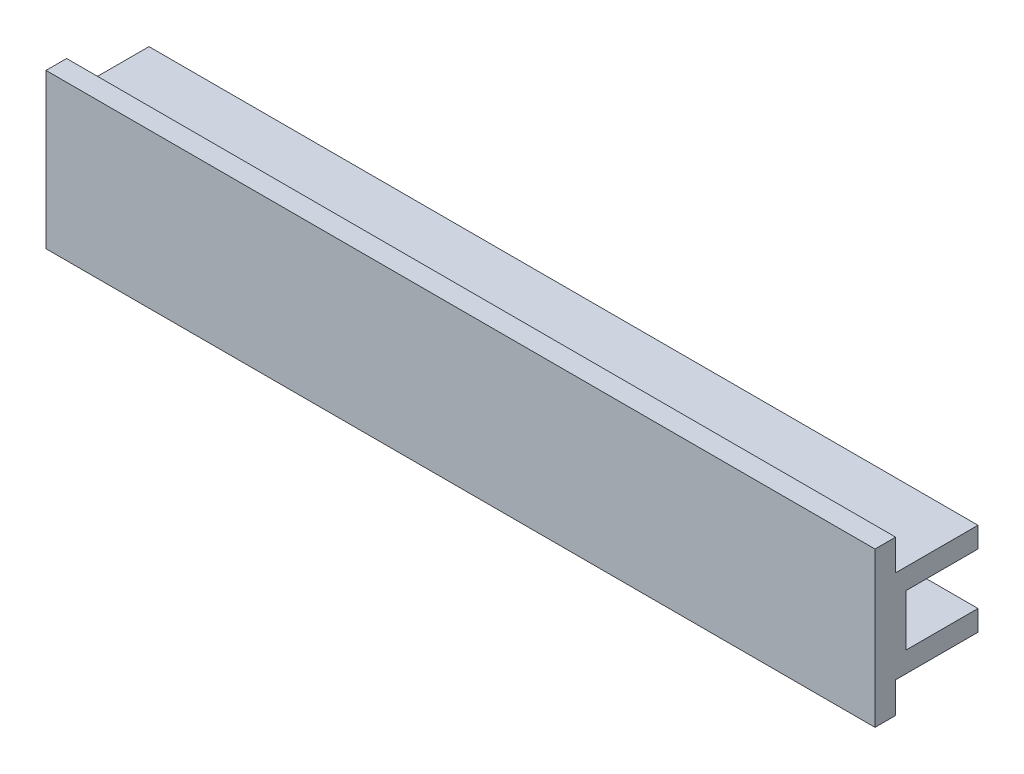
ISO-10303-21;
HEADER;
FILE_DESCRIPTION(('STEP AP214'),'2;1');
FILE_NAME('part.step','',(''),(''),'','','');
FILE_SCHEMA(('AUTOMOTIVE_DESIGN { 1 0 10303 214 1 1 1 1 }'));
ENDSEC;
DATA;
#1=APPLICATION_CONTEXT('core data for automotive mechanical design processes');
#2=APPLICATION_PROTOCOL_DEFINITION('international standard','automotive_design',2000,#1);
#3=PRODUCT_CONTEXT('',#1,'mechanical');
#4=PRODUCT('Part','Part','',(#3));
#5=PRODUCT_RELATED_PRODUCT_CATEGORY('part','',(#4));
#6=PRODUCT_DEFINITION_FORMATION('','',#4);
#7=PRODUCT_DEFINITION_CONTEXT('part definition',#1,'design');
#8=PRODUCT_DEFINITION('design','',#6,#7);
#9=PRODUCT_DEFINITION_SHAPE('','',#8);
#10=(LENGTH_UNIT() NAMED_UNIT(*) SI_UNIT(.MILLI.,.METRE.));
#11=(NAMED_UNIT(*) PLANE_ANGLE_UNIT() SI_UNIT($,.RADIAN.));
#12=(NAMED_UNIT(*) SI_UNIT($,.STERADIAN.) SOLID_ANGLE_UNIT());
#13=UNCERTAINTY_MEASURE_WITH_UNIT(LENGTH_MEASURE(1.E-05),#10,'distance_accuracy_value','');
#14=(GEOMETRIC_REPRESENTATION_CONTEXT(3) GLOBAL_UNCERTAINTY_ASSIGNED_CONTEXT((#13)) GLOBAL_UNIT_ASSIGNED_CONTEXT((#10,
#11,#12)) REPRESENTATION_CONTEXT('',''));
#15=CARTESIAN_POINT('',(0.,0.,0.));
#16=DIRECTION('',(0.,0.,1.));
#17=DIRECTION('',(1.,0.,0.));
#18=AXIS2_PLACEMENT_3D('',#15,#16,#17);
#19=CARTESIAN_POINT('',(40.25,7.5,5.));
#20=DIRECTION('',(0.,0.,-1.));
#21=DIRECTION('',(0.,1.,0.));
#22=AXIS2_PLACEMENT_3D('',#19,#20,#21);
#23=PLANE('',#22);
#24=DIRECTION('',(0.,-1.,0.));
#25=VECTOR('',#24,1.);
#26=CARTESIAN_POINT('',(-40.25,7.5,5.));
#27=LINE('',#26,#25);
#28=CARTESIAN_POINT('',(-40.25,7.5,5.));
#29=VERTEX_POINT('',#28);
#30=CARTESIAN_POINT('',(-40.25,-7.5,5.));
#31=VERTEX_POINT('',#30);
#32=EDGE_CURVE('E150',#29,#31,#27,.T.);
#33=ORIENTED_EDGE('',*,*,#32,.T.);
#34=DIRECTION('',(-1.,0.,0.));
#35=VECTOR('',#34,1.);
#36=CARTESIAN_POINT('',(40.25,-7.5,5.));
#37=LINE('',#36,#35);
#38=CARTESIAN_POINT('',(40.25,-7.5,5.));
#39=VERTEX_POINT('',#38);
#40=EDGE_CURVE('E11',#39,#31,#37,.T.);
#41=ORIENTED_EDGE('',*,*,#40,.F.);
#42=DIRECTION('',(0.,-1.,0.));
#43=VECTOR('',#42,1.);
#44=CARTESIAN_POINT('',(40.25,7.5,5.));
#45=LINE('',#44,#43);
#46=CARTESIAN_POINT('',(40.25,7.5,5.));
#47=VERTEX_POINT('',#46);
#48=EDGE_CURVE('E172',#47,#39,#45,.T.);
#49=ORIENTED_EDGE('',*,*,#48,.F.);
#50=DIRECTION('',(-1.,0.,0.));
#51=VECTOR('',#50,1.);
#52=CARTESIAN_POINT('',(40.25,7.5,5.));
#53=LINE('',#52,#51);
#54=EDGE_CURVE('E146',#47,#29,#53,.T.);
#55=ORIENTED_EDGE('',*,*,#54,.T.);
#56=EDGE_LOOP('',(#33,#41,#49,#55));
#57=FACE_BOUND('',#56,.T.);
#58=ADVANCED_FACE('F32',(#57),#23,.F.);
#59=CARTESIAN_POINT('',(40.25,-7.5,5.));
#60=DIRECTION('',(0.,1.,0.));
#61=DIRECTION('',(0.,0.,1.));
#62=AXIS2_PLACEMENT_3D('',#59,#60,#61);
#63=PLANE('',#62);
#64=DIRECTION('',(0.,0.,-1.));
#65=VECTOR('',#64,1.);
#66=CARTESIAN_POINT('',(-40.25,-7.5,5.));
#67=LINE('',#66,#65);
#68=CARTESIAN_POINT('',(-40.25,-7.5,3.));
#69=VERTEX_POINT('',#68);
#70=EDGE_CURVE('E153',#31,#69,#67,.T.);
#71=ORIENTED_EDGE('',*,*,#70,.T.);
#72=DIRECTION('',(-1.,0.,0.));
#73=VECTOR('',#72,1.);
#74=CARTESIAN_POINT('',(40.25,-7.5,3.));
#75=LINE('',#74,#73);
#76=CARTESIAN_POINT('',(40.25,-7.5,3.));
#77=VERTEX_POINT('',#76);
#78=EDGE_CURVE('E40',#77,#69,#75,.T.);
#79=ORIENTED_EDGE('',*,*,#78,.F.);
#80=DIRECTION('',(0.,0.,-1.));
#81=VECTOR('',#80,1.);
#82=CARTESIAN_POINT('',(40.25,-7.5,5.));
#83=LINE('',#82,#81);
#84=EDGE_CURVE('E98',#39,#77,#83,.T.);
#85=ORIENTED_EDGE('',*,*,#84,.F.);
#86=ORIENTED_EDGE('',*,*,#40,.T.);
#87=EDGE_LOOP('',(#71,#79,#85,#86));
#88=FACE_BOUND('',#87,.T.);
#89=ADVANCED_FACE('F251',(#88),#63,.F.);
#90=CARTESIAN_POINT('',(40.25,-4.5,3.));
#91=DIRECTION('',(0.,0.,1.));
#92=DIRECTION('',(1.,0.,0.));
#93=AXIS2_PLACEMENT_3D('',#90,#91,#92);
#94=PLANE('',#93);
#95=DIRECTION('',(0.,1.,0.));
#96=VECTOR('',#95,1.);
#97=CARTESIAN_POINT('',(-40.25,-4.5,3.));
#98=LINE('',#97,#96);
#99=CARTESIAN_POINT('',(-40.25,-4.5,3.));
#100=VERTEX_POINT('',#99);
#101=EDGE_CURVE('E156',#69,#100,#98,.T.);
#102=ORIENTED_EDGE('',*,*,#101,.T.);
#103=DIRECTION('',(-1.,0.,0.));
#104=VECTOR('',#103,1.);
#105=CARTESIAN_POINT('',(40.25,-4.5,3.));
#106=LINE('',#105,#104);
#107=CARTESIAN_POINT('',(40.25,-4.5,3.));
#108=VERTEX_POINT('',#107);
#109=EDGE_CURVE('E191',#108,#100,#106,.T.);
#110=ORIENTED_EDGE('',*,*,#109,.F.);
#111=DIRECTION('',(0.,1.,0.));
#112=VECTOR('',#111,1.);
#113=CARTESIAN_POINT('',(40.25,-4.5,3.));
#114=LINE('',#113,#112);
#115=EDGE_CURVE('E199',#77,#108,#114,.T.);
#116=ORIENTED_EDGE('',*,*,#115,.F.);
#117=ORIENTED_EDGE('',*,*,#78,.T.);
#118=EDGE_LOOP('',(#102,#110,#116,#117));
#119=FACE_BOUND('',#118,.T.);
#120=ADVANCED_FACE('F197',(#119),#94,.F.);
#121=CARTESIAN_POINT('',(40.25,-4.5,-5.));
#122=DIRECTION('',(0.,1.,0.));
#123=DIRECTION('',(0.,0.,1.));
#124=AXIS2_PLACEMENT_3D('',#121,#122,#123);
#125=PLANE('',#124);
#126=DIRECTION('',(0.,0.,-1.));
#127=VECTOR('',#126,1.);
#128=CARTESIAN_POINT('',(-40.25,-4.5,-5.));
#129=LINE('',#128,#127);
#130=CARTESIAN_POINT('',(-40.25,-4.5,-5.));
#131=VERTEX_POINT('',#130);
#132=EDGE_CURVE('E158',#100,#131,#129,.T.);
#133=ORIENTED_EDGE('',*,*,#132,.T.);
#134=DIRECTION('',(-1.,0.,0.));
#135=VECTOR('',#134,1.);
#136=CARTESIAN_POINT('',(40.25,-4.5,-5.));
#137=LINE('',#136,#135);
#138=CARTESIAN_POINT('',(40.25,-4.5,-5.));
#139=VERTEX_POINT('',#138);
#140=EDGE_CURVE('E188',#139,#131,#137,.T.);
#141=ORIENTED_EDGE('',*,*,#140,.F.);
#142=DIRECTION('',(0.,0.,-1.));
#143=VECTOR('',#142,1.);
#144=CARTESIAN_POINT('',(40.25,-4.5,-5.));
#145=LINE('',#144,#143);
#146=EDGE_CURVE('E218',#108,#139,#145,.T.);
#147=ORIENTED_EDGE('',*,*,#146,.F.);
#148=ORIENTED_EDGE('',*,*,#109,.T.);
#149=EDGE_LOOP('',(#133,#141,#147,#148));
#150=FACE_BOUND('',#149,.T.);
#151=ADVANCED_FACE('F209',(#150),#125,.F.);
#152=CARTESIAN_POINT('',(40.25,-2.5,-5.));
#153=DIRECTION('',(0.,0.,1.));
#154=DIRECTION('',(0.,-1.,0.));
#155=AXIS2_PLACEMENT_3D('',#152,#153,#154);
#156=PLANE('',#155);
#157=DIRECTION('',(0.,1.,0.));
#158=VECTOR('',#157,1.);
#159=CARTESIAN_POINT('',(-40.25,-2.5,-5.));
#160=LINE('',#159,#158);
#161=CARTESIAN_POINT('',(-40.25,-2.5,-5.));
#162=VERTEX_POINT('',#161);
#163=EDGE_CURVE('E160',#131,#162,#160,.T.);
#164=ORIENTED_EDGE('',*,*,#163,.T.);
#165=DIRECTION('',(-1.,0.,0.));
#166=VECTOR('',#165,1.);
#167=CARTESIAN_POINT('',(40.25,-2.5,-5.));
#168=LINE('',#167,#166);
#169=CARTESIAN_POINT('',(40.25,-2.5,-5.));
#170=VERTEX_POINT('',#169);
#171=EDGE_CURVE('E185',#170,#162,#168,.T.);
#172=ORIENTED_EDGE('',*,*,#171,.F.);
#173=DIRECTION('',(0.,1.,0.));
#174=VECTOR('',#173,1.);
#175=CARTESIAN_POINT('',(40.25,-2.5,-5.));
#176=LINE('',#175,#174);
#177=EDGE_CURVE('E215',#139,#170,#176,.T.);
#178=ORIENTED_EDGE('',*,*,#177,.F.);
#179=ORIENTED_EDGE('',*,*,#140,.T.);
#180=EDGE_LOOP('',(#164,#172,#178,#179));
#181=FACE_BOUND('',#180,.T.);
#182=ADVANCED_FACE('F213',(#181),#156,.F.);
#183=CARTESIAN_POINT('',(40.25,-2.5,2.));
#184=DIRECTION('',(0.,-1.,0.));
#185=DIRECTION('',(0.,0.,-1.));
#186=AXIS2_PLACEMENT_3D('',#183,#184,#185);
#187=PLANE('',#186);
#188=DIRECTION('',(0.,0.,1.));
#189=VECTOR('',#188,1.);
#190=CARTESIAN_POINT('',(-40.25,-2.5,2.));
#191=LINE('',#190,#189);
#192=CARTESIAN_POINT('',(-40.25,-2.5,3.));
#193=VERTEX_POINT('',#192);
#194=EDGE_CURVE('E162',#162,#193,#191,.T.);
#195=ORIENTED_EDGE('',*,*,#194,.T.);
#196=DIRECTION('',(-1.,0.,0.));
#197=VECTOR('',#196,1.);
#198=CARTESIAN_POINT('',(-18.25,-2.5,3.));
#199=LINE('',#198,#197);
#200=CARTESIAN_POINT('',(-18.25,-2.5,3.));
#201=VERTEX_POINT('',#200);
#202=EDGE_CURVE('E364',#201,#193,#199,.T.);
#203=ORIENTED_EDGE('',*,*,#202,.F.);
#204=DIRECTION('',(0.,0.,1.));
#205=VECTOR('',#204,1.);
#206=CARTESIAN_POINT('',(-18.25,-2.5,3.));
#207=LINE('',#206,#205);
#208=CARTESIAN_POINT('',(-18.25,-2.5,2.));
#209=VERTEX_POINT('',#208);
#210=EDGE_CURVE('E355',#209,#201,#207,.T.);
#211=ORIENTED_EDGE('',*,*,#210,.F.);
#212=DIRECTION('',(-1.,0.,0.));
#213=VECTOR('',#212,1.);
#214=CARTESIAN_POINT('',(40.25,-2.5,2.));
#215=LINE('',#214,#213);
#216=CARTESIAN_POINT('',(40.25,-2.5,2.));
#217=VERTEX_POINT('',#216);
#218=EDGE_CURVE('E182',#217,#209,#215,.T.);
#219=ORIENTED_EDGE('',*,*,#218,.F.);
#220=DIRECTION('',(0.,0.,1.));
#221=VECTOR('',#220,1.);
#222=CARTESIAN_POINT('',(40.25,-2.5,2.));
#223=LINE('',#222,#221);
#224=EDGE_CURVE('E217',#170,#217,#223,.T.);
#225=ORIENTED_EDGE('',*,*,#224,.F.);
#226=ORIENTED_EDGE('',*,*,#171,.T.);
#227=EDGE_LOOP('',(#195,#203,#211,#219,#225,#226));
#228=FACE_BOUND('',#227,.T.);
#229=ADVANCED_FACE('F264',(#228),#187,.F.);
#230=CARTESIAN_POINT('',(40.25,2.5,2.));
#231=DIRECTION('',(0.,0.,1.));
#232=DIRECTION('',(0.,-1.,0.));
#233=AXIS2_PLACEMENT_3D('',#230,#231,#232);
#234=PLANE('',#233);
#235=ORIENTED_EDGE('',*,*,#218,.T.);
#236=DIRECTION('',(0.,-1.,0.));
#237=VECTOR('',#236,1.);
#238=CARTESIAN_POINT('',(-18.25,-2.5,2.));
#239=LINE('',#238,#237);
#240=CARTESIAN_POINT('',(-18.25,2.5,2.));
#241=VERTEX_POINT('',#240);
#242=EDGE_CURVE('E351',#241,#209,#239,.T.);
#243=ORIENTED_EDGE('',*,*,#242,.F.);
#244=DIRECTION('',(-1.,0.,0.));
#245=VECTOR('',#244,1.);
#246=CARTESIAN_POINT('',(40.25,2.5,2.));
#247=LINE('',#246,#245);
#248=CARTESIAN_POINT('',(40.25,2.5,2.));
#249=VERTEX_POINT('',#248);
#250=EDGE_CURVE('E179',#249,#241,#247,.T.);
#251=ORIENTED_EDGE('',*,*,#250,.F.);
#252=DIRECTION('',(0.,1.,0.));
#253=VECTOR('',#252,1.);
#254=CARTESIAN_POINT('',(40.25,2.5,2.));
#255=LINE('',#254,#253);
#256=EDGE_CURVE('E220',#217,#249,#255,.T.);
#257=ORIENTED_EDGE('',*,*,#256,.F.);
#258=EDGE_LOOP('',(#235,#243,#251,#257));
#259=FACE_BOUND('',#258,.T.);
#260=ADVANCED_FACE('F267',(#259),#234,.F.);
#261=CARTESIAN_POINT('',(40.25,2.5,-5.));
#262=DIRECTION('',(0.,1.,0.));
#263=DIRECTION('',(0.,0.,1.));
#264=AXIS2_PLACEMENT_3D('',#261,#262,#263);
#265=PLANE('',#264);
#266=DIRECTION('',(0.,0.,-1.));
#267=VECTOR('',#266,1.);
#268=CARTESIAN_POINT('',(-40.25,2.5,-5.));
#269=LINE('',#268,#267);
#270=CARTESIAN_POINT('',(-40.25,2.5,3.));
#271=VERTEX_POINT('',#270);
#272=CARTESIAN_POINT('',(-40.25,2.5,-5.));
#273=VERTEX_POINT('',#272);
#274=EDGE_CURVE('E165',#271,#273,#269,.T.);
#275=ORIENTED_EDGE('',*,*,#274,.T.);
#276=DIRECTION('',(-1.,0.,0.));
#277=VECTOR('',#276,1.);
#278=CARTESIAN_POINT('',(40.25,2.5,-5.));
#279=LINE('',#278,#277);
#280=CARTESIAN_POINT('',(40.25,2.5,-5.));
#281=VERTEX_POINT('',#280);
#282=EDGE_CURVE('E176',#281,#273,#279,.T.);
#283=ORIENTED_EDGE('',*,*,#282,.F.);
#284=DIRECTION('',(0.,0.,-1.));
#285=VECTOR('',#284,1.);
#286=CARTESIAN_POINT('',(40.25,2.5,-5.));
#287=LINE('',#286,#285);
#288=EDGE_CURVE('E226',#249,#281,#287,.T.);
#289=ORIENTED_EDGE('',*,*,#288,.F.);
#290=ORIENTED_EDGE('',*,*,#250,.T.);
#291=DIRECTION('',(0.,0.,-1.));
#292=VECTOR('',#291,1.);
#293=CARTESIAN_POINT('',(-18.25,2.5,2.));
#294=LINE('',#293,#292);
#295=CARTESIAN_POINT('',(-18.25,2.5,3.));
#296=VERTEX_POINT('',#295);
#297=EDGE_CURVE('E357',#296,#241,#294,.T.);
#298=ORIENTED_EDGE('',*,*,#297,.F.);
#299=DIRECTION('',(-1.,0.,0.));
#300=VECTOR('',#299,1.);
#301=CARTESIAN_POINT('',(-18.25,2.5,3.));
#302=LINE('',#301,#300);
#303=EDGE_CURVE('E154',#296,#271,#302,.T.);
#304=ORIENTED_EDGE('',*,*,#303,.T.);
#305=EDGE_LOOP('',(#275,#283,#289,#290,#298,#304));
#306=FACE_BOUND('',#305,.T.);
#307=ADVANCED_FACE('F232',(#306),#265,.F.);
#308=CARTESIAN_POINT('',(40.25,4.5,-5.));
#309=DIRECTION('',(0.,0.,1.));
#310=DIRECTION('',(1.,0.,0.));
#311=AXIS2_PLACEMENT_3D('',#308,#309,#310);
#312=PLANE('',#311);
#313=DIRECTION('',(0.,1.,0.));
#314=VECTOR('',#313,1.);
#315=CARTESIAN_POINT('',(-40.25,4.5,-5.));
#316=LINE('',#315,#314);
#317=CARTESIAN_POINT('',(-40.25,4.5,-5.));
#318=VERTEX_POINT('',#317);
#319=EDGE_CURVE('E167',#273,#318,#316,.T.);
#320=ORIENTED_EDGE('',*,*,#319,.T.);
#321=DIRECTION('',(-1.,0.,0.));
#322=VECTOR('',#321,1.);
#323=CARTESIAN_POINT('',(40.25,4.5,-5.));
#324=LINE('',#323,#322);
#325=CARTESIAN_POINT('',(40.25,4.5,-5.));
#326=VERTEX_POINT('',#325);
#327=EDGE_CURVE('E141',#326,#318,#324,.T.);
#328=ORIENTED_EDGE('',*,*,#327,.F.);
#329=DIRECTION('',(0.,1.,0.));
#330=VECTOR('',#329,1.);
#331=CARTESIAN_POINT('',(40.25,4.5,-5.));
#332=LINE('',#331,#330);
#333=EDGE_CURVE('E132',#281,#326,#332,.T.);
#334=ORIENTED_EDGE('',*,*,#333,.F.);
#335=ORIENTED_EDGE('',*,*,#282,.T.);
#336=EDGE_LOOP('',(#320,#328,#334,#335));
#337=FACE_BOUND('',#336,.T.);
#338=ADVANCED_FACE('F236',(#337),#312,.F.);
#339=CARTESIAN_POINT('',(40.25,4.5,3.));
#340=DIRECTION('',(0.,-1.,0.));
#341=DIRECTION('',(0.,0.,-1.));
#342=AXIS2_PLACEMENT_3D('',#339,#340,#341);
#343=PLANE('',#342);
#344=DIRECTION('',(0.,0.,1.));
#345=VECTOR('',#344,1.);
#346=CARTESIAN_POINT('',(-40.25,4.5,3.));
#347=LINE('',#346,#345);
#348=CARTESIAN_POINT('',(-40.25,4.5,3.));
#349=VERTEX_POINT('',#348);
#350=EDGE_CURVE('E140',#318,#349,#347,.T.);
#351=ORIENTED_EDGE('',*,*,#350,.T.);
#352=DIRECTION('',(-1.,0.,0.));
#353=VECTOR('',#352,1.);
#354=CARTESIAN_POINT('',(40.25,4.5,3.));
#355=LINE('',#354,#353);
#356=CARTESIAN_POINT('',(40.25,4.5,3.));
#357=VERTEX_POINT('',#356);
#358=EDGE_CURVE('E137',#357,#349,#355,.T.);
#359=ORIENTED_EDGE('',*,*,#358,.F.);
#360=DIRECTION('',(0.,0.,1.));
#361=VECTOR('',#360,1.);
#362=CARTESIAN_POINT('',(40.25,4.5,3.));
#363=LINE('',#362,#361);
#364=EDGE_CURVE('E126',#326,#357,#363,.T.);
#365=ORIENTED_EDGE('',*,*,#364,.F.);
#366=ORIENTED_EDGE('',*,*,#327,.T.);
#367=EDGE_LOOP('',(#351,#359,#365,#366));
#368=FACE_BOUND('',#367,.T.);
#369=ADVANCED_FACE('F138',(#368),#343,.F.);
#370=CARTESIAN_POINT('',(40.25,7.5,3.));
#371=DIRECTION('',(0.,0.,1.));
#372=DIRECTION('',(0.,-1.,0.));
#373=AXIS2_PLACEMENT_3D('',#370,#371,#372);
#374=PLANE('',#373);
#375=DIRECTION('',(0.,1.,0.));
#376=VECTOR('',#375,1.);
#377=CARTESIAN_POINT('',(-40.25,7.5,3.));
#378=LINE('',#377,#376);
#379=CARTESIAN_POINT('',(-40.25,7.5,3.));
#380=VERTEX_POINT('',#379);
#381=EDGE_CURVE('E84',#349,#380,#378,.T.);
#382=ORIENTED_EDGE('',*,*,#381,.T.);
#383=DIRECTION('',(-1.,0.,0.));
#384=VECTOR('',#383,1.);
#385=CARTESIAN_POINT('',(40.25,7.5,3.));
#386=LINE('',#385,#384);
#387=CARTESIAN_POINT('',(40.25,7.5,3.));
#388=VERTEX_POINT('',#387);
#389=EDGE_CURVE('E142',#388,#380,#386,.T.);
#390=ORIENTED_EDGE('',*,*,#389,.F.);
#391=DIRECTION('',(0.,1.,0.));
#392=VECTOR('',#391,1.);
#393=CARTESIAN_POINT('',(40.25,7.5,3.));
#394=LINE('',#393,#392);
#395=EDGE_CURVE('E130',#357,#388,#394,.T.);
#396=ORIENTED_EDGE('',*,*,#395,.F.);
#397=ORIENTED_EDGE('',*,*,#358,.T.);
#398=EDGE_LOOP('',(#382,#390,#396,#397));
#399=FACE_BOUND('',#398,.T.);
#400=ADVANCED_FACE('F144',(#399),#374,.F.);
#401=CARTESIAN_POINT('',(40.25,7.5,5.));
#402=DIRECTION('',(0.,-1.,0.));
#403=DIRECTION('',(0.,0.,-1.));
#404=AXIS2_PLACEMENT_3D('',#401,#402,#403);
#405=PLANE('',#404);
#406=DIRECTION('',(0.,0.,1.));
#407=VECTOR('',#406,1.);
#408=CARTESIAN_POINT('',(-40.25,7.5,5.));
#409=LINE('',#408,#407);
#410=EDGE_CURVE('E90',#380,#29,#409,.T.);
#411=ORIENTED_EDGE('',*,*,#410,.T.);
#412=ORIENTED_EDGE('',*,*,#54,.F.);
#413=DIRECTION('',(0.,0.,1.));
#414=VECTOR('',#413,1.);
#415=CARTESIAN_POINT('',(40.25,7.5,5.));
#416=LINE('',#415,#414);
#417=EDGE_CURVE('E48',#388,#47,#416,.T.);
#418=ORIENTED_EDGE('',*,*,#417,.F.);
#419=ORIENTED_EDGE('',*,*,#389,.T.);
#420=EDGE_LOOP('',(#411,#412,#418,#419));
#421=FACE_BOUND('',#420,.T.);
#422=ADVANCED_FACE('F240',(#421),#405,.F.);
#423=CARTESIAN_POINT('',(40.25,-7.5,5.));
#424=DIRECTION('',(1.,0.,0.));
#425=DIRECTION('',(0.,0.,-1.));
#426=AXIS2_PLACEMENT_3D('',#423,#424,#425);
#427=PLANE('',#426);
#428=ORIENTED_EDGE('',*,*,#48,.T.);
#429=ORIENTED_EDGE('',*,*,#84,.T.);
#430=ORIENTED_EDGE('',*,*,#115,.T.);
#431=ORIENTED_EDGE('',*,*,#146,.T.);
#432=ORIENTED_EDGE('',*,*,#177,.T.);
#433=ORIENTED_EDGE('',*,*,#224,.T.);
#434=ORIENTED_EDGE('',*,*,#256,.T.);
#435=ORIENTED_EDGE('',*,*,#288,.T.);
#436=ORIENTED_EDGE('',*,*,#333,.T.);
#437=ORIENTED_EDGE('',*,*,#364,.T.);
#438=ORIENTED_EDGE('',*,*,#395,.T.);
#439=ORIENTED_EDGE('',*,*,#417,.T.);
#440=EDGE_LOOP('',(#428,#429,#430,#431,#432,#433,#434,#435,#436,#437,#438,#439));
#441=FACE_BOUND('',#440,.T.);
#442=ADVANCED_FACE('F128',(#441),#427,.T.);
#443=CARTESIAN_POINT('',(-40.25,-7.5,5.));
#444=DIRECTION('',(1.,0.,0.));
#445=DIRECTION('',(0.,0.,-1.));
#446=AXIS2_PLACEMENT_3D('',#443,#444,#445);
#447=PLANE('',#446);
#448=ORIENTED_EDGE('',*,*,#274,.F.);
#449=DIRECTION('',(0.,1.,0.));
#450=VECTOR('',#449,1.);
#451=CARTESIAN_POINT('',(-40.25,2.5,3.));
#452=LINE('',#451,#450);
#453=EDGE_CURVE('E359',#193,#271,#452,.T.);
#454=ORIENTED_EDGE('',*,*,#453,.F.);
#455=ORIENTED_EDGE('',*,*,#194,.F.);
#456=ORIENTED_EDGE('',*,*,#163,.F.);
#457=ORIENTED_EDGE('',*,*,#132,.F.);
#458=ORIENTED_EDGE('',*,*,#101,.F.);
#459=ORIENTED_EDGE('',*,*,#70,.F.);
#460=ORIENTED_EDGE('',*,*,#32,.F.);
#461=ORIENTED_EDGE('',*,*,#410,.F.);
#462=ORIENTED_EDGE('',*,*,#381,.F.);
#463=ORIENTED_EDGE('',*,*,#350,.F.);
#464=ORIENTED_EDGE('',*,*,#319,.F.);
#465=EDGE_LOOP('',(#448,#454,#455,#456,#457,#458,#459,#460,#461,#462,#463,#464));
#466=FACE_BOUND('',#465,.T.);
#467=ADVANCED_FACE('F203',(#466),#447,.F.);
#468=CARTESIAN_POINT('',(-18.25,2.5,3.));
#469=DIRECTION('',(0.,0.,1.));
#470=DIRECTION('',(0.,-1.,0.));
#471=AXIS2_PLACEMENT_3D('',#468,#469,#470);
#472=PLANE('',#471);
#473=ORIENTED_EDGE('',*,*,#453,.T.);
#474=ORIENTED_EDGE('',*,*,#303,.F.);
#475=DIRECTION('',(0.,1.,0.));
#476=VECTOR('',#475,1.);
#477=CARTESIAN_POINT('',(-18.25,2.5,3.));
#478=LINE('',#477,#476);
#479=EDGE_CURVE('E366',#201,#296,#478,.T.);
#480=ORIENTED_EDGE('',*,*,#479,.F.);
#481=ORIENTED_EDGE('',*,*,#202,.T.);
#482=EDGE_LOOP('',(#473,#474,#480,#481));
#483=FACE_BOUND('',#482,.T.);
#484=ADVANCED_FACE('F325',(#483),#472,.F.);
#485=CARTESIAN_POINT('',(-18.25,2.5,2.));
#486=DIRECTION('',(1.,0.,0.));
#487=DIRECTION('',(0.,0.,-1.));
#488=AXIS2_PLACEMENT_3D('',#485,#486,#487);
#489=PLANE('',#488);
#490=ORIENTED_EDGE('',*,*,#242,.T.);
#491=ORIENTED_EDGE('',*,*,#210,.T.);
#492=ORIENTED_EDGE('',*,*,#479,.T.);
#493=ORIENTED_EDGE('',*,*,#297,.T.);
#494=EDGE_LOOP('',(#490,#491,#492,#493));
#495=FACE_BOUND('',#494,.T.);
#496=ADVANCED_FACE('F332',(#495),#489,.F.);
#497=CLOSED_SHELL('',(#58,#89,#120,#151,#182,#229,#260,#307,#338,#369,#400,#422,#442,#467,#484,#496));
#498=MANIFOLD_SOLID_BREP('B2',#497);
#499=ADVANCED_BREP_SHAPE_REPRESENTATION('',(#18,#498),#14);
#500=SHAPE_DEFINITION_REPRESENTATION(#9,#499);
ENDSEC;
END-ISO-10303-21;
